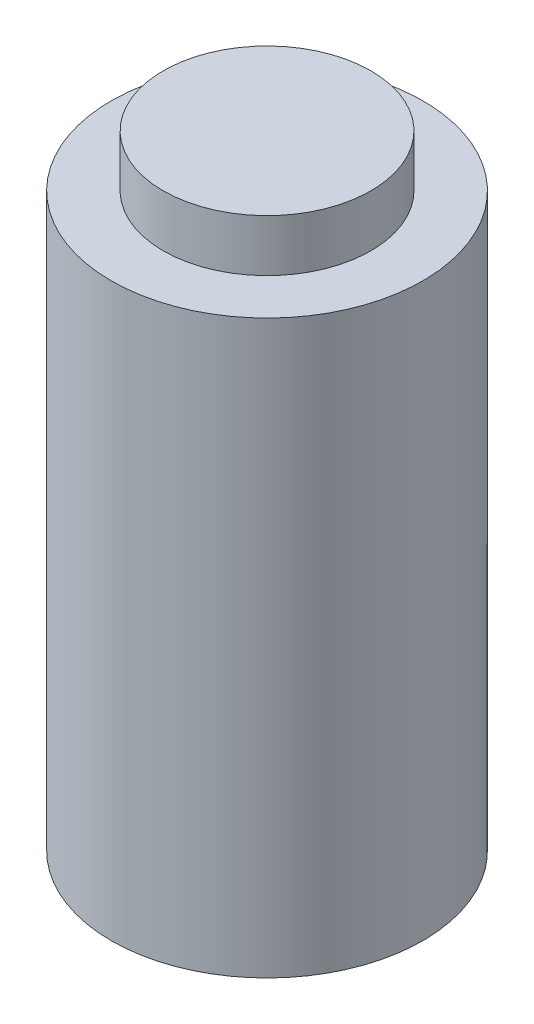
ISO-10303-21;
HEADER;
FILE_DESCRIPTION(('STEP AP214'),'2;1');
FILE_NAME('part.step','',(''),(''),'','','');
FILE_SCHEMA(('AUTOMOTIVE_DESIGN { 1 0 10303 214 1 1 1 1 }'));
ENDSEC;
DATA;
#1=APPLICATION_CONTEXT('core data for automotive mechanical design processes');
#2=APPLICATION_PROTOCOL_DEFINITION('international standard','automotive_design',2000,#1);
#3=PRODUCT_CONTEXT('',#1,'mechanical');
#4=PRODUCT('Part','Part','',(#3));
#5=PRODUCT_RELATED_PRODUCT_CATEGORY('part','',(#4));
#6=PRODUCT_DEFINITION_FORMATION('','',#4);
#7=PRODUCT_DEFINITION_CONTEXT('part definition',#1,'design');
#8=PRODUCT_DEFINITION('design','',#6,#7);
#9=PRODUCT_DEFINITION_SHAPE('','',#8);
#10=(LENGTH_UNIT() NAMED_UNIT(*) SI_UNIT(.MILLI.,.METRE.));
#11=(NAMED_UNIT(*) PLANE_ANGLE_UNIT() SI_UNIT($,.RADIAN.));
#12=(NAMED_UNIT(*) SI_UNIT($,.STERADIAN.) SOLID_ANGLE_UNIT());
#13=UNCERTAINTY_MEASURE_WITH_UNIT(LENGTH_MEASURE(1.E-05),#10,'distance_accuracy_value','');
#14=(GEOMETRIC_REPRESENTATION_CONTEXT(3) GLOBAL_UNCERTAINTY_ASSIGNED_CONTEXT((#13)) GLOBAL_UNIT_ASSIGNED_CONTEXT((#10,
#11,#12)) REPRESENTATION_CONTEXT('',''));
#15=CARTESIAN_POINT('',(0.,0.,0.));
#16=DIRECTION('',(0.,0.,1.));
#17=DIRECTION('',(1.,0.,0.));
#18=AXIS2_PLACEMENT_3D('',#15,#16,#17);
#19=CARTESIAN_POINT('',(0.,139.7,0.));
#20=DIRECTION('',(0.,-1.,0.));
#21=DIRECTION('',(0.,0.,-1.));
#22=AXIS2_PLACEMENT_3D('',#19,#20,#21);
#23=CYLINDRICAL_SURFACE('',#22,38.1);
#24=CARTESIAN_POINT('',(0.,139.7,0.));
#25=DIRECTION('',(0.,1.,0.));
#26=DIRECTION('',(0.,0.,1.));
#27=AXIS2_PLACEMENT_3D('',#24,#25,#26);
#28=CIRCLE('',#27,38.1);
#29=CARTESIAN_POINT('',(0.,139.7,38.1));
#30=VERTEX_POINT('',#29);
#31=EDGE_CURVE('E42',#30,#30,#28,.T.);
#32=ORIENTED_EDGE('',*,*,#31,.F.);
#33=EDGE_LOOP('',(#32));
#34=FACE_BOUND('',#33,.T.);
#35=CARTESIAN_POINT('',(0.,0.,0.));
#36=DIRECTION('',(0.,1.,0.));
#37=DIRECTION('',(0.,0.,1.));
#38=AXIS2_PLACEMENT_3D('',#35,#36,#37);
#39=CIRCLE('',#38,38.1);
#40=CARTESIAN_POINT('',(0.,0.,38.1));
#41=VERTEX_POINT('',#40);
#42=EDGE_CURVE('E38',#41,#41,#39,.T.);
#43=ORIENTED_EDGE('',*,*,#42,.T.);
#44=EDGE_LOOP('',(#43));
#45=FACE_BOUND('',#44,.T.);
#46=ADVANCED_FACE('F35',(#34,#45),#23,.T.);
#47=CARTESIAN_POINT('',(0.,139.7,0.));
#48=DIRECTION('',(0.,1.,0.));
#49=DIRECTION('',(0.,0.,1.));
#50=AXIS2_PLACEMENT_3D('',#47,#48,#49);
#51=PLANE('',#50);
#52=CARTESIAN_POINT('',(0.,139.7,0.));
#53=DIRECTION('',(0.,1.,0.));
#54=DIRECTION('',(0.,0.,1.));
#55=AXIS2_PLACEMENT_3D('',#52,#53,#54);
#56=CIRCLE('',#55,25.4);
#57=CARTESIAN_POINT('',(0.,139.7,25.4));
#58=VERTEX_POINT('',#57);
#59=EDGE_CURVE('E10',#58,#58,#56,.T.);
#60=ORIENTED_EDGE('',*,*,#59,.F.);
#61=EDGE_LOOP('',(#60));
#62=FACE_BOUND('',#61,.T.);
#63=ORIENTED_EDGE('',*,*,#31,.T.);
#64=EDGE_LOOP('',(#63));
#65=FACE_BOUND('',#64,.T.);
#66=ADVANCED_FACE('F59',(#62,#65),#51,.T.);
#67=CARTESIAN_POINT('',(0.,0.,0.));
#68=DIRECTION('',(0.,1.,0.));
#69=DIRECTION('',(0.,0.,1.));
#70=AXIS2_PLACEMENT_3D('',#67,#68,#69);
#71=PLANE('',#70);
#72=ORIENTED_EDGE('',*,*,#42,.F.);
#73=EDGE_LOOP('',(#72));
#74=FACE_BOUND('',#73,.T.);
#75=ADVANCED_FACE('F56',(#74),#71,.F.);
#76=CARTESIAN_POINT('',(0.,152.4,0.));
#77=DIRECTION('',(0.,-1.,0.));
#78=DIRECTION('',(0.,0.,-1.));
#79=AXIS2_PLACEMENT_3D('',#76,#77,#78);
#80=CYLINDRICAL_SURFACE('',#79,25.4);
#81=CARTESIAN_POINT('',(0.,152.4,0.));
#82=DIRECTION('',(0.,1.,0.));
#83=DIRECTION('',(0.,0.,1.));
#84=AXIS2_PLACEMENT_3D('',#81,#82,#83);
#85=CIRCLE('',#84,25.4);
#86=CARTESIAN_POINT('',(0.,152.4,25.4));
#87=VERTEX_POINT('',#86);
#88=EDGE_CURVE('E48',#87,#87,#85,.T.);
#89=ORIENTED_EDGE('',*,*,#88,.F.);
#90=EDGE_LOOP('',(#89));
#91=FACE_BOUND('',#90,.T.);
#92=ORIENTED_EDGE('',*,*,#59,.T.);
#93=EDGE_LOOP('',(#92));
#94=FACE_BOUND('',#93,.T.);
#95=ADVANCED_FACE('F58',(#91,#94),#80,.T.);
#96=CARTESIAN_POINT('',(0.,152.4,0.));
#97=DIRECTION('',(0.,1.,0.));
#98=DIRECTION('',(0.,0.,1.));
#99=AXIS2_PLACEMENT_3D('',#96,#97,#98);
#100=PLANE('',#99);
#101=ORIENTED_EDGE('',*,*,#88,.T.);
#102=EDGE_LOOP('',(#101));
#103=FACE_BOUND('',#102,.T.);
#104=ADVANCED_FACE('F64',(#103),#100,.T.);
#105=CLOSED_SHELL('',(#46,#66,#75,#95,#104));
#106=MANIFOLD_SOLID_BREP('B2',#105);
#107=ADVANCED_BREP_SHAPE_REPRESENTATION('',(#18,#106),#14);
#108=SHAPE_DEFINITION_REPRESENTATION(#9,#107);
ENDSEC;
END-ISO-10303-21;
